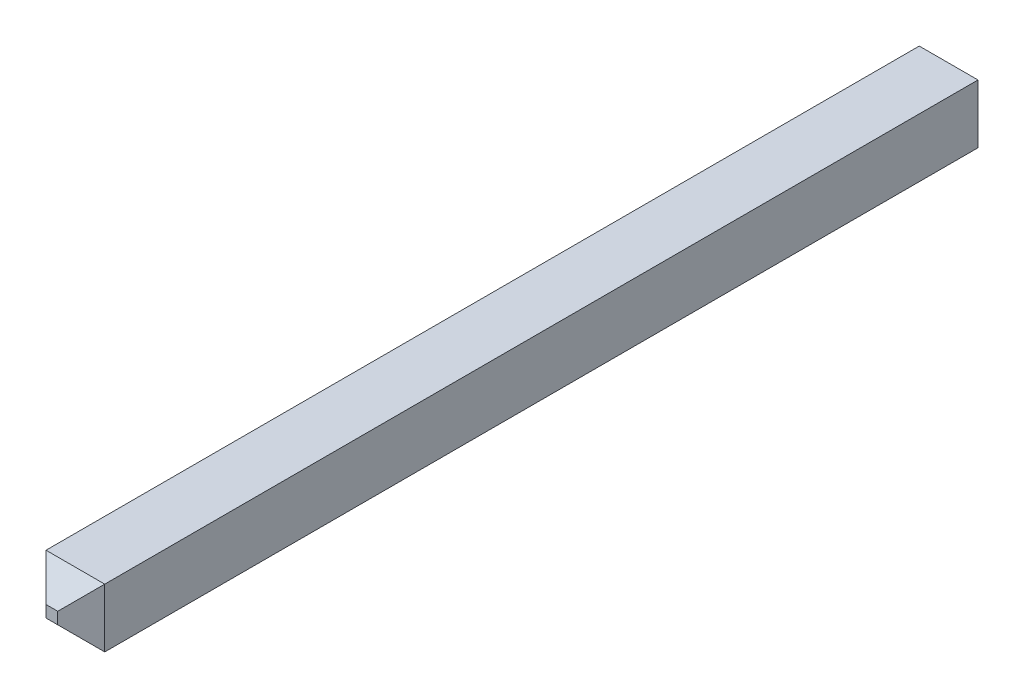
ISO-10303-21;
HEADER;
FILE_DESCRIPTION(('STEP AP214'),'2;1');
FILE_NAME('part.step','',(''),(''),'','','');
FILE_SCHEMA(('AUTOMOTIVE_DESIGN { 1 0 10303 214 1 1 1 1 }'));
ENDSEC;
DATA;
#1=APPLICATION_CONTEXT('core data for automotive mechanical design processes');
#2=APPLICATION_PROTOCOL_DEFINITION('international standard','automotive_design',2000,#1);
#3=PRODUCT_CONTEXT('',#1,'mechanical');
#4=PRODUCT('Part','Part','',(#3));
#5=PRODUCT_RELATED_PRODUCT_CATEGORY('part','',(#4));
#6=PRODUCT_DEFINITION_FORMATION('','',#4);
#7=PRODUCT_DEFINITION_CONTEXT('part definition',#1,'design');
#8=PRODUCT_DEFINITION('design','',#6,#7);
#9=PRODUCT_DEFINITION_SHAPE('','',#8);
#10=(LENGTH_UNIT() NAMED_UNIT(*) SI_UNIT(.MILLI.,.METRE.));
#11=(NAMED_UNIT(*) PLANE_ANGLE_UNIT() SI_UNIT($,.RADIAN.));
#12=(NAMED_UNIT(*) SI_UNIT($,.STERADIAN.) SOLID_ANGLE_UNIT());
#13=UNCERTAINTY_MEASURE_WITH_UNIT(LENGTH_MEASURE(1.E-05),#10,'distance_accuracy_value','');
#14=(GEOMETRIC_REPRESENTATION_CONTEXT(3) GLOBAL_UNCERTAINTY_ASSIGNED_CONTEXT((#13)) GLOBAL_UNIT_ASSIGNED_CONTEXT((#10,
#11,#12)) REPRESENTATION_CONTEXT('',''));
#15=CARTESIAN_POINT('',(0.,0.,0.));
#16=DIRECTION('',(0.,0.,1.));
#17=DIRECTION('',(1.,0.,0.));
#18=AXIS2_PLACEMENT_3D('',#15,#16,#17);
#19=CARTESIAN_POINT('',(0.831975872170931,-0.902265312346261,-0.0505976377952756));
#20=DIRECTION('',(0.,-0.707106781186552,0.707106781186543));
#21=DIRECTION('',(0.,-0.707106781186543,-0.707106781186552));
#22=AXIS2_PLACEMENT_3D('',#19,#20,#21);
#23=PLANE('',#22);
#24=DIRECTION('',(1.,0.,0.));
#25=VECTOR('',#24,1.);
#26=CARTESIAN_POINT('',(0.818983746186679,-0.914666887149411,-0.0629992125984253));
#27=LINE('',#26,#25);
#28=CARTESIAN_POINT('',(0.818688470596129,-0.914666887149411,-0.0629992125984252));
#29=VERTEX_POINT('',#28);
#30=CARTESIAN_POINT('',(0.812782958785105,-0.914666887149411,-0.0629992125984255));
#31=VERTEX_POINT('',#30);
#32=EDGE_CURVE('E111',#29,#31,#27,.F.);
#33=ORIENTED_EDGE('',*,*,#32,.T.);
#34=DIRECTION('',(0.577350269189616,-0.577350269189637,-0.577350269189624));
#35=VECTOR('',#34,1.);
#36=CARTESIAN_POINT('',(0.800971935163057,-0.902855863527363,-0.0511881889763777));
#37=LINE('',#36,#35);
#38=CARTESIAN_POINT('',(0.800971935163057,-0.902855863527363,-0.0511881889763778));
#39=VERTEX_POINT('',#38);
#40=EDGE_CURVE('E116',#39,#31,#37,.T.);
#41=ORIENTED_EDGE('',*,*,#40,.F.);
#42=DIRECTION('',(1.,0.,0.));
#43=VECTOR('',#42,1.);
#44=CARTESIAN_POINT('',(0.831975872170931,-0.902855863527363,-0.0511881889763779));
#45=LINE('',#44,#43);
#46=CARTESIAN_POINT('',(0.830499494218176,-0.902855863527363,-0.0511881889763778));
#47=VERTEX_POINT('',#46);
#48=EDGE_CURVE('E120',#47,#39,#45,.F.);
#49=ORIENTED_EDGE('',*,*,#48,.F.);
#50=DIRECTION('',(0.577350269189609,0.577350269189652,0.577350269189616));
#51=VECTOR('',#50,1.);
#52=CARTESIAN_POINT('',(0.818688470596129,-0.914666887149411,-0.062999212598425));
#53=LINE('',#52,#51);
#54=EDGE_CURVE('E79',#29,#47,#53,.T.);
#55=ORIENTED_EDGE('',*,*,#54,.F.);
#56=EDGE_LOOP('',(#33,#41,#49,#55));
#57=FACE_BOUND('',#56,.T.);
#58=ADVANCED_FACE('F17',(#57),#23,.F.);
#59=CARTESIAN_POINT('',(0.799495557210302,-0.915257438330513,0.400189763779528));
#60=DIRECTION('',(0.,0.707106781186543,0.707106781186552));
#61=DIRECTION('',(0.,-0.707106781186552,0.707106781186543));
#62=AXIS2_PLACEMENT_3D('',#59,#60,#61);
#63=PLANE('',#62);
#64=DIRECTION('',(0.57735026918962,-0.577350269189641,0.577350269189615));
#65=VECTOR('',#64,1.);
#66=CARTESIAN_POINT('',(0.800971935163057,-0.902855863527363,0.387788188976378));
#67=LINE('',#66,#65);
#68=CARTESIAN_POINT('',(0.800971935163057,-0.902855863527363,0.387788188976378));
#69=VERTEX_POINT('',#68);
#70=CARTESIAN_POINT('',(0.812782958785105,-0.914666887149411,0.399599212598425));
#71=VERTEX_POINT('',#70);
#72=EDGE_CURVE('E90',#69,#71,#67,.T.);
#73=ORIENTED_EDGE('',*,*,#72,.T.);
#74=DIRECTION('',(1.,0.,0.));
#75=VECTOR('',#74,1.);
#76=CARTESIAN_POINT('',(0.818983746186679,-0.914666887149411,0.399599212598425));
#77=LINE('',#76,#75);
#78=CARTESIAN_POINT('',(0.818688470596129,-0.914666887149411,0.399599212598425));
#79=VERTEX_POINT('',#78);
#80=EDGE_CURVE('E20',#79,#71,#77,.F.);
#81=ORIENTED_EDGE('',*,*,#80,.F.);
#82=DIRECTION('',(0.577350269189614,0.577350269189657,-0.577350269189606));
#83=VECTOR('',#82,1.);
#84=CARTESIAN_POINT('',(0.818688470596129,-0.914666887149411,0.399599212598425));
#85=LINE('',#84,#83);
#86=CARTESIAN_POINT('',(0.830499494218176,-0.902855863527363,0.387788188976378));
#87=VERTEX_POINT('',#86);
#88=EDGE_CURVE('E88',#79,#87,#85,.T.);
#89=ORIENTED_EDGE('',*,*,#88,.T.);
#90=DIRECTION('',(1.,0.,0.));
#91=VECTOR('',#90,1.);
#92=CARTESIAN_POINT('',(0.831975872170931,-0.902855863527363,0.387788188976378));
#93=LINE('',#92,#91);
#94=EDGE_CURVE('E122',#69,#87,#93,.T.);
#95=ORIENTED_EDGE('',*,*,#94,.F.);
#96=EDGE_LOOP('',(#73,#81,#89,#95));
#97=FACE_BOUND('',#96,.T.);
#98=ADVANCED_FACE('F86',(#97),#63,.T.);
#99=CARTESIAN_POINT('',(0.818983746186679,-0.914371611558859,0.399599212598425));
#100=DIRECTION('',(0.,0.,1.));
#101=DIRECTION('',(0.,-1.,0.));
#102=AXIS2_PLACEMENT_3D('',#99,#100,#101);
#103=PLANE('',#102);
#104=DIRECTION('',(0.,1.,0.));
#105=VECTOR('',#104,1.);
#106=CARTESIAN_POINT('',(0.812782958785105,-0.901379485574608,0.399599212598425));
#107=LINE('',#106,#105);
#108=CARTESIAN_POINT('',(0.812782958785105,-0.920572398960434,0.399599212598425));
#109=VERTEX_POINT('',#108);
#110=EDGE_CURVE('E114',#71,#109,#107,.F.);
#111=ORIENTED_EDGE('',*,*,#110,.T.);
#112=DIRECTION('',(1.,0.,0.));
#113=VECTOR('',#112,1.);
#114=CARTESIAN_POINT('',(0.799495557210302,-0.920572398960435,0.399599212598426));
#115=LINE('',#114,#113);
#116=CARTESIAN_POINT('',(0.818688470596129,-0.920572398960434,0.399599212598425));
#117=VERTEX_POINT('',#116);
#118=EDGE_CURVE('E105',#109,#117,#115,.T.);
#119=ORIENTED_EDGE('',*,*,#118,.T.);
#120=DIRECTION('',(0.,1.,0.));
#121=VECTOR('',#120,1.);
#122=CARTESIAN_POINT('',(0.818688470596129,-0.933859800535237,0.399599212598425));
#123=LINE('',#122,#121);
#124=EDGE_CURVE('E94',#117,#79,#123,.T.);
#125=ORIENTED_EDGE('',*,*,#124,.T.);
#126=ORIENTED_EDGE('',*,*,#80,.T.);
#127=EDGE_LOOP('',(#111,#119,#125,#126));
#128=FACE_BOUND('',#127,.T.);
#129=ADVANCED_FACE('F103',(#128),#103,.T.);
#130=CARTESIAN_POINT('',(0.818097919415026,-0.933859800535237,0.400189763779528));
#131=DIRECTION('',(-0.707106781186544,0.,-0.707106781186551));
#132=DIRECTION('',(-0.707106781186551,0.,0.707106781186544));
#133=AXIS2_PLACEMENT_3D('',#130,#131,#132);
#134=PLANE('',#133);
#135=ORIENTED_EDGE('',*,*,#88,.F.);
#136=ORIENTED_EDGE('',*,*,#124,.F.);
#137=DIRECTION('',(0.57735026918961,-0.577350269189636,-0.577350269189631));
#138=VECTOR('',#137,1.);
#139=CARTESIAN_POINT('',(0.818688470596129,-0.920572398960435,0.399599212598426));
#140=LINE('',#139,#138);
#141=CARTESIAN_POINT('',(0.830499494218176,-0.932383422582482,0.387788188976378));
#142=VERTEX_POINT('',#141);
#143=EDGE_CURVE('E128',#117,#142,#140,.T.);
#144=ORIENTED_EDGE('',*,*,#143,.T.);
#145=DIRECTION('',(0.,-1.,0.));
#146=VECTOR('',#145,1.);
#147=CARTESIAN_POINT('',(0.830499494218176,-0.901379485574607,0.387788188976378));
#148=LINE('',#147,#146);
#149=EDGE_CURVE('E100',#142,#87,#148,.F.);
#150=ORIENTED_EDGE('',*,*,#149,.T.);
#151=EDGE_LOOP('',(#135,#136,#144,#150));
#152=FACE_BOUND('',#151,.T.);
#153=ADVANCED_FACE('F97',(#152),#134,.F.);
#154=CARTESIAN_POINT('',(0.831090045399278,-0.901379485574607,-0.0505976377952756));
#155=DIRECTION('',(0.707106781186552,0.,-0.707106781186543));
#156=DIRECTION('',(-0.707106781186543,0.,-0.707106781186552));
#157=AXIS2_PLACEMENT_3D('',#154,#155,#156);
#158=PLANE('',#157);
#159=DIRECTION('',(0.,-1.,0.));
#160=VECTOR('',#159,1.);
#161=CARTESIAN_POINT('',(0.830499494218176,-0.901379485574607,-0.0511881889763779));
#162=LINE('',#161,#160);
#163=CARTESIAN_POINT('',(0.830499494218176,-0.932383422582482,-0.0511881889763778));
#164=VERTEX_POINT('',#163);
#165=EDGE_CURVE('E134',#47,#164,#162,.T.);
#166=ORIENTED_EDGE('',*,*,#165,.T.);
#167=DIRECTION('',(0.577350269189603,-0.577350269189635,0.57735026918964));
#168=VECTOR('',#167,1.);
#169=CARTESIAN_POINT('',(0.818688470596129,-0.920572398960434,-0.0629992125984256));
#170=LINE('',#169,#168);
#171=CARTESIAN_POINT('',(0.818688470596129,-0.920572398960434,-0.0629992125984252));
#172=VERTEX_POINT('',#171);
#173=EDGE_CURVE('E137',#172,#164,#170,.T.);
#174=ORIENTED_EDGE('',*,*,#173,.F.);
#175=DIRECTION('',(0.,-1.,0.));
#176=VECTOR('',#175,1.);
#177=CARTESIAN_POINT('',(0.818688470596129,-0.914371611558859,-0.0629992125984253));
#178=LINE('',#177,#176);
#179=EDGE_CURVE('E108',#172,#29,#178,.F.);
#180=ORIENTED_EDGE('',*,*,#179,.T.);
#181=ORIENTED_EDGE('',*,*,#54,.T.);
#182=EDGE_LOOP('',(#166,#174,#180,#181));
#183=FACE_BOUND('',#182,.T.);
#184=ADVANCED_FACE('F205',(#183),#158,.T.);
#185=CARTESIAN_POINT('',(0.818983746186679,-0.914371611558859,-0.0629992125984253));
#186=DIRECTION('',(0.,0.,1.));
#187=DIRECTION('',(0.,-1.,0.));
#188=AXIS2_PLACEMENT_3D('',#185,#186,#187);
#189=PLANE('',#188);
#190=ORIENTED_EDGE('',*,*,#32,.F.);
#191=ORIENTED_EDGE('',*,*,#179,.F.);
#192=DIRECTION('',(1.,0.,0.));
#193=VECTOR('',#192,1.);
#194=CARTESIAN_POINT('',(0.831975872170931,-0.920572398960434,-0.0629992125984256));
#195=LINE('',#194,#193);
#196=CARTESIAN_POINT('',(0.812782958785105,-0.920572398960434,-0.0629992125984255));
#197=VERTEX_POINT('',#196);
#198=EDGE_CURVE('E142',#197,#172,#195,.T.);
#199=ORIENTED_EDGE('',*,*,#198,.F.);
#200=DIRECTION('',(0.,1.,0.));
#201=VECTOR('',#200,1.);
#202=CARTESIAN_POINT('',(0.812782958785105,-0.933859800535237,-0.0629992125984255));
#203=LINE('',#202,#201);
#204=EDGE_CURVE('E118',#31,#197,#203,.F.);
#205=ORIENTED_EDGE('',*,*,#204,.F.);
#206=EDGE_LOOP('',(#190,#191,#199,#205));
#207=FACE_BOUND('',#206,.T.);
#208=ADVANCED_FACE('F202',(#207),#189,.F.);
#209=CARTESIAN_POINT('',(0.813373509966207,-0.901379485574608,0.400189763779528));
#210=DIRECTION('',(0.707106781186544,0.,-0.707106781186551));
#211=DIRECTION('',(-0.707106781186551,0.,-0.707106781186544));
#212=AXIS2_PLACEMENT_3D('',#209,#210,#211);
#213=PLANE('',#212);
#214=ORIENTED_EDGE('',*,*,#72,.F.);
#215=DIRECTION('',(0.,1.,0.));
#216=VECTOR('',#215,1.);
#217=CARTESIAN_POINT('',(0.800971935163057,-0.933859800535237,0.387788188976378));
#218=LINE('',#217,#216);
#219=CARTESIAN_POINT('',(0.800971935163057,-0.932383422582482,0.387788188976378));
#220=VERTEX_POINT('',#219);
#221=EDGE_CURVE('E145',#69,#220,#218,.F.);
#222=ORIENTED_EDGE('',*,*,#221,.T.);
#223=DIRECTION('',(0.577350269189641,0.57735026918962,0.577350269189615));
#224=VECTOR('',#223,1.);
#225=CARTESIAN_POINT('',(0.800971935163057,-0.932383422582482,0.387788188976378));
#226=LINE('',#225,#224);
#227=EDGE_CURVE('E124',#220,#109,#226,.T.);
#228=ORIENTED_EDGE('',*,*,#227,.T.);
#229=ORIENTED_EDGE('',*,*,#110,.F.);
#230=EDGE_LOOP('',(#214,#222,#228,#229));
#231=FACE_BOUND('',#230,.T.);
#232=ADVANCED_FACE('F176',(#231),#213,.F.);
#233=CARTESIAN_POINT('',(0.800381383981955,-0.933859800535237,-0.0505976377952756));
#234=DIRECTION('',(-0.707106781186552,0.,-0.707106781186543));
#235=DIRECTION('',(-0.707106781186543,0.,0.707106781186552));
#236=AXIS2_PLACEMENT_3D('',#233,#234,#235);
#237=PLANE('',#236);
#238=ORIENTED_EDGE('',*,*,#204,.T.);
#239=DIRECTION('',(0.577350269189635,0.577350269189619,-0.577350269189624));
#240=VECTOR('',#239,1.);
#241=CARTESIAN_POINT('',(0.800971935163057,-0.932383422582482,-0.0511881889763778));
#242=LINE('',#241,#240);
#243=CARTESIAN_POINT('',(0.800971935163057,-0.932383422582482,-0.0511881889763778));
#244=VERTEX_POINT('',#243);
#245=EDGE_CURVE('E139',#244,#197,#242,.T.);
#246=ORIENTED_EDGE('',*,*,#245,.F.);
#247=DIRECTION('',(0.,1.,0.));
#248=VECTOR('',#247,1.);
#249=CARTESIAN_POINT('',(0.800971935163057,-0.933859800535237,-0.0511881889763779));
#250=LINE('',#249,#248);
#251=EDGE_CURVE('E34',#244,#39,#250,.T.);
#252=ORIENTED_EDGE('',*,*,#251,.T.);
#253=ORIENTED_EDGE('',*,*,#40,.T.);
#254=EDGE_LOOP('',(#238,#246,#252,#253));
#255=FACE_BOUND('',#254,.T.);
#256=ADVANCED_FACE('F195',(#255),#237,.T.);
#257=CARTESIAN_POINT('',(0.831975872170931,-0.902855863527363,0.152158267716535));
#258=DIRECTION('',(0.,1.,0.));
#259=DIRECTION('',(0.,0.,1.));
#260=AXIS2_PLACEMENT_3D('',#257,#258,#259);
#261=PLANE('',#260);
#262=DIRECTION('',(0.,0.,1.));
#263=VECTOR('',#262,1.);
#264=CARTESIAN_POINT('',(0.800971935163057,-0.902855863527363,0.152158267716535));
#265=LINE('',#264,#263);
#266=EDGE_CURVE('E149',#39,#69,#265,.T.);
#267=ORIENTED_EDGE('',*,*,#266,.T.);
#268=ORIENTED_EDGE('',*,*,#94,.T.);
#269=DIRECTION('',(0.,0.,1.));
#270=VECTOR('',#269,1.);
#271=CARTESIAN_POINT('',(0.830499494218176,-0.902855863527363,0.152158267716535));
#272=LINE('',#271,#270);
#273=EDGE_CURVE('E131',#87,#47,#272,.F.);
#274=ORIENTED_EDGE('',*,*,#273,.T.);
#275=ORIENTED_EDGE('',*,*,#48,.T.);
#276=EDGE_LOOP('',(#267,#268,#274,#275));
#277=FACE_BOUND('',#276,.T.);
#278=ADVANCED_FACE('F192',(#277),#261,.T.);
#279=CARTESIAN_POINT('',(0.799495557210302,-0.919981847779332,0.400189763779528));
#280=DIRECTION('',(0.,0.707106781186544,-0.707106781186551));
#281=DIRECTION('',(0.,0.707106781186551,0.707106781186544));
#282=AXIS2_PLACEMENT_3D('',#279,#280,#281);
#283=PLANE('',#282);
#284=ORIENTED_EDGE('',*,*,#118,.F.);
#285=ORIENTED_EDGE('',*,*,#227,.F.);
#286=DIRECTION('',(1.,0.,0.));
#287=VECTOR('',#286,1.);
#288=CARTESIAN_POINT('',(0.831975872170931,-0.932383422582482,0.387788188976378));
#289=LINE('',#288,#287);
#290=EDGE_CURVE('E152',#220,#142,#289,.T.);
#291=ORIENTED_EDGE('',*,*,#290,.T.);
#292=ORIENTED_EDGE('',*,*,#143,.F.);
#293=EDGE_LOOP('',(#284,#285,#291,#292));
#294=FACE_BOUND('',#293,.T.);
#295=ADVANCED_FACE('F173',(#294),#283,.F.);
#296=CARTESIAN_POINT('',(0.830499494218176,-0.901379485574607,0.152158267716535));
#297=DIRECTION('',(-1.,0.,0.));
#298=DIRECTION('',(0.,-1.,0.));
#299=AXIS2_PLACEMENT_3D('',#296,#297,#298);
#300=PLANE('',#299);
#301=ORIENTED_EDGE('',*,*,#165,.F.);
#302=ORIENTED_EDGE('',*,*,#273,.F.);
#303=ORIENTED_EDGE('',*,*,#149,.F.);
#304=DIRECTION('',(0.,0.,1.));
#305=VECTOR('',#304,1.);
#306=CARTESIAN_POINT('',(0.830499494218176,-0.932383422582482,0.152158267716535));
#307=LINE('',#306,#305);
#308=EDGE_CURVE('E155',#142,#164,#307,.F.);
#309=ORIENTED_EDGE('',*,*,#308,.T.);
#310=EDGE_LOOP('',(#301,#302,#303,#309));
#311=FACE_BOUND('',#310,.T.);
#312=ADVANCED_FACE('F171',(#311),#300,.F.);
#313=CARTESIAN_POINT('',(0.831975872170931,-0.932973973763584,-0.0505976377952756));
#314=DIRECTION('',(0.,-0.707106781186551,-0.707106781186544));
#315=DIRECTION('',(0.,0.707106781186544,-0.707106781186551));
#316=AXIS2_PLACEMENT_3D('',#313,#314,#315);
#317=PLANE('',#316);
#318=ORIENTED_EDGE('',*,*,#245,.T.);
#319=ORIENTED_EDGE('',*,*,#198,.T.);
#320=ORIENTED_EDGE('',*,*,#173,.T.);
#321=DIRECTION('',(1.,0.,0.));
#322=VECTOR('',#321,1.);
#323=CARTESIAN_POINT('',(0.831975872170931,-0.932383422582482,-0.0511881889763779));
#324=LINE('',#323,#322);
#325=EDGE_CURVE('E26',#164,#244,#324,.F.);
#326=ORIENTED_EDGE('',*,*,#325,.T.);
#327=EDGE_LOOP('',(#318,#319,#320,#326));
#328=FACE_BOUND('',#327,.T.);
#329=ADVANCED_FACE('F161',(#328),#317,.T.);
#330=CARTESIAN_POINT('',(0.800971935163057,-0.933859800535237,0.152158267716535));
#331=DIRECTION('',(1.,0.,0.));
#332=DIRECTION('',(0.,1.,0.));
#333=AXIS2_PLACEMENT_3D('',#330,#331,#332);
#334=PLANE('',#333);
#335=ORIENTED_EDGE('',*,*,#251,.F.);
#336=DIRECTION('',(0.,0.,1.));
#337=VECTOR('',#336,1.);
#338=CARTESIAN_POINT('',(0.800971935163057,-0.932383422582482,0.152158267716535));
#339=LINE('',#338,#337);
#340=EDGE_CURVE('E11',#244,#220,#339,.T.);
#341=ORIENTED_EDGE('',*,*,#340,.T.);
#342=ORIENTED_EDGE('',*,*,#221,.F.);
#343=ORIENTED_EDGE('',*,*,#266,.F.);
#344=EDGE_LOOP('',(#335,#341,#342,#343));
#345=FACE_BOUND('',#344,.T.);
#346=ADVANCED_FACE('F177',(#345),#334,.F.);
#347=CARTESIAN_POINT('',(0.831975872170931,-0.932383422582482,0.152158267716535));
#348=DIRECTION('',(0.,1.,0.));
#349=DIRECTION('',(0.,0.,1.));
#350=AXIS2_PLACEMENT_3D('',#347,#348,#349);
#351=PLANE('',#350);
#352=ORIENTED_EDGE('',*,*,#325,.F.);
#353=ORIENTED_EDGE('',*,*,#308,.F.);
#354=ORIENTED_EDGE('',*,*,#290,.F.);
#355=ORIENTED_EDGE('',*,*,#340,.F.);
#356=EDGE_LOOP('',(#352,#353,#354,#355));
#357=FACE_BOUND('',#356,.T.);
#358=ADVANCED_FACE('F167',(#357),#351,.F.);
#359=CLOSED_SHELL('',(#58,#98,#129,#153,#184,#208,#232,#256,#278,#295,#312,#329,#346,#358));
#360=MANIFOLD_SOLID_BREP('B1',#359);
#361=ADVANCED_BREP_SHAPE_REPRESENTATION('',(#18,#360),#14);
#362=SHAPE_DEFINITION_REPRESENTATION(#9,#361);
ENDSEC;
END-ISO-10303-21;
